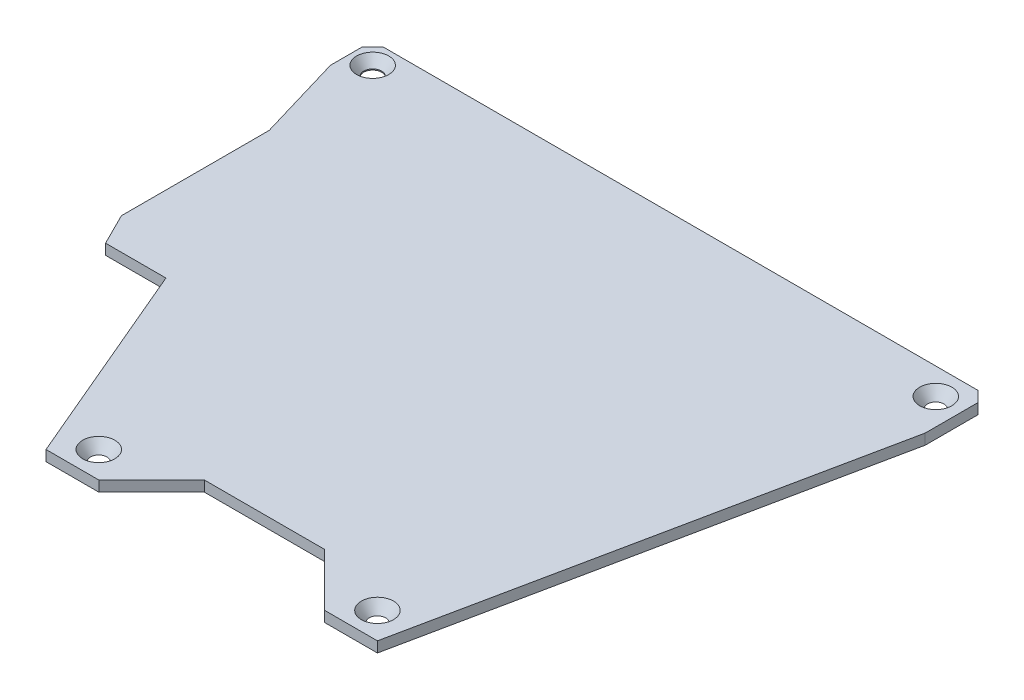
ISO-10303-21;
HEADER;
FILE_DESCRIPTION(('STEP AP214'),'2;1');
FILE_NAME('part.step','',(''),(''),'','','');
FILE_SCHEMA(('AUTOMOTIVE_DESIGN { 1 0 10303 214 1 1 1 1 }'));
ENDSEC;
DATA;
#1=APPLICATION_CONTEXT('core data for automotive mechanical design processes');
#2=APPLICATION_PROTOCOL_DEFINITION('international standard','automotive_design',2000,#1);
#3=PRODUCT_CONTEXT('',#1,'mechanical');
#4=PRODUCT('Part','Part','',(#3));
#5=PRODUCT_RELATED_PRODUCT_CATEGORY('part','',(#4));
#6=PRODUCT_DEFINITION_FORMATION('','',#4);
#7=PRODUCT_DEFINITION_CONTEXT('part definition',#1,'design');
#8=PRODUCT_DEFINITION('design','',#6,#7);
#9=PRODUCT_DEFINITION_SHAPE('','',#8);
#10=(LENGTH_UNIT() NAMED_UNIT(*) SI_UNIT(.MILLI.,.METRE.));
#11=(NAMED_UNIT(*) PLANE_ANGLE_UNIT() SI_UNIT($,.RADIAN.));
#12=(NAMED_UNIT(*) SI_UNIT($,.STERADIAN.) SOLID_ANGLE_UNIT());
#13=UNCERTAINTY_MEASURE_WITH_UNIT(LENGTH_MEASURE(1.E-05),#10,'distance_accuracy_value','');
#14=(GEOMETRIC_REPRESENTATION_CONTEXT(3) GLOBAL_UNCERTAINTY_ASSIGNED_CONTEXT((#13)) GLOBAL_UNIT_ASSIGNED_CONTEXT((#10,
#11,#12)) REPRESENTATION_CONTEXT('',''));
#15=CARTESIAN_POINT('',(0.,0.,0.));
#16=DIRECTION('',(0.,0.,1.));
#17=DIRECTION('',(1.,0.,0.));
#18=AXIS2_PLACEMENT_3D('',#15,#16,#17);
#19=CARTESIAN_POINT('',(-62.5600947046115,254.946051229394,83.7172856261732));
#20=DIRECTION('',(0.,1.,0.));
#21=DIRECTION('',(0.,0.,1.));
#22=AXIS2_PLACEMENT_3D('',#19,#20,#21);
#23=CYLINDRICAL_SURFACE('',#22,1.7);
#24=DIRECTION('',(0.,1.,0.));
#25=VECTOR('',#24,1.);
#26=CARTESIAN_POINT('',(-62.5600947046115,254.946051229395,85.4172856261731));
#27=LINE('',#26,#25);
#28=CARTESIAN_POINT('',(-62.5600947046113,262.946051229395,85.4172856261729));
#29=VERTEX_POINT('',#28);
#30=CARTESIAN_POINT('',(-62.5600947046113,263.146051229395,85.4172856261728));
#31=VERTEX_POINT('',#30);
#32=EDGE_CURVE('E50',#29,#31,#27,.T.);
#33=ORIENTED_EDGE('',*,*,#32,.T.);
#34=CARTESIAN_POINT('',(-62.5600947046113,263.146051229395,83.7172856261729));
#35=DIRECTION('',(0.,1.,0.));
#36=DIRECTION('',(0.,0.,1.));
#37=AXIS2_PLACEMENT_3D('',#34,#35,#36);
#38=CIRCLE('',#37,1.7);
#39=CARTESIAN_POINT('',(-62.5600947046113,263.146051229395,82.0172856261729));
#40=VERTEX_POINT('',#39);
#41=EDGE_CURVE('E57',#31,#40,#38,.T.);
#42=ORIENTED_EDGE('',*,*,#41,.T.);
#43=DIRECTION('',(0.,1.,0.));
#44=VECTOR('',#43,1.);
#45=CARTESIAN_POINT('',(-62.5600947046115,254.946051229394,82.0172856261732));
#46=LINE('',#45,#44);
#47=CARTESIAN_POINT('',(-62.5600947046113,262.946051229395,82.0172856261729));
#48=VERTEX_POINT('',#47);
#49=EDGE_CURVE('E246',#48,#40,#46,.T.);
#50=ORIENTED_EDGE('',*,*,#49,.F.);
#51=CARTESIAN_POINT('',(-62.5600947046113,262.946051229395,83.7172856261729));
#52=DIRECTION('',(0.,1.,0.));
#53=DIRECTION('',(0.,0.,1.));
#54=AXIS2_PLACEMENT_3D('',#51,#52,#53);
#55=CIRCLE('',#54,1.7);
#56=EDGE_CURVE('E334',#29,#48,#55,.T.);
#57=ORIENTED_EDGE('',*,*,#56,.F.);
#58=EDGE_LOOP('',(#33,#42,#50,#57));
#59=FACE_BOUND('',#58,.T.);
#60=ADVANCED_FACE('F40',(#59),#23,.F.);
#61=CARTESIAN_POINT('',(-66.5600947046043,264.946051229394,81.7172856261735));
#62=DIRECTION('',(-0.707106781192606,0.,-0.707106781180489));
#63=DIRECTION('',(-0.707106781180489,0.,0.707106781192606));
#64=AXIS2_PLACEMENT_3D('',#61,#62,#63);
#65=PLANE('',#64);
#66=DIRECTION('',(0.707106781180489,0.,-0.707106781192606));
#67=VECTOR('',#66,1.);
#68=CARTESIAN_POINT('',(-66.5600947046043,264.946051229394,81.7172856261735));
#69=LINE('',#68,#67);
#70=CARTESIAN_POINT('',(-66.5600947046043,264.946051229394,81.7172856261735));
#71=VERTEX_POINT('',#70);
#72=CARTESIAN_POINT('',(-64.5600947046386,264.946051229394,79.7172856261736));
#73=VERTEX_POINT('',#72);
#74=EDGE_CURVE('E211',#71,#73,#69,.T.);
#75=ORIENTED_EDGE('',*,*,#74,.T.);
#76=DIRECTION('',(0.,-1.,0.));
#77=VECTOR('',#76,1.);
#78=CARTESIAN_POINT('',(-64.5600947046386,264.946051229394,79.7172856261736));
#79=LINE('',#78,#77);
#80=CARTESIAN_POINT('',(-64.5600947046386,262.946051229394,79.7172856261736));
#81=VERTEX_POINT('',#80);
#82=EDGE_CURVE('E203',#73,#81,#79,.T.);
#83=ORIENTED_EDGE('',*,*,#82,.T.);
#84=DIRECTION('',(0.707106781180489,0.,-0.707106781192606));
#85=VECTOR('',#84,1.);
#86=CARTESIAN_POINT('',(-66.5600947046043,262.946051229394,81.7172856261736));
#87=LINE('',#86,#85);
#88=CARTESIAN_POINT('',(-66.5600947046043,262.946051229394,81.7172856261736));
#89=VERTEX_POINT('',#88);
#90=EDGE_CURVE('E208',#89,#81,#87,.T.);
#91=ORIENTED_EDGE('',*,*,#90,.F.);
#92=DIRECTION('',(0.,-1.,0.));
#93=VECTOR('',#92,1.);
#94=CARTESIAN_POINT('',(-66.5600947046043,264.946051229394,81.7172856261735));
#95=LINE('',#94,#93);
#96=EDGE_CURVE('E12',#71,#89,#95,.T.);
#97=ORIENTED_EDGE('',*,*,#96,.F.);
#98=EDGE_LOOP('',(#75,#83,#91,#97));
#99=FACE_BOUND('',#98,.T.);
#100=ADVANCED_FACE('F205',(#99),#65,.T.);
#101=CARTESIAN_POINT('',(-66.5600947046217,262.946051229395,85.7172856261758));
#102=DIRECTION('',(-1.,0.,0.));
#103=DIRECTION('',(0.,0.,1.));
#104=AXIS2_PLACEMENT_3D('',#101,#102,#103);
#105=PLANE('',#104);
#106=DIRECTION('',(0.,0.,-1.));
#107=VECTOR('',#106,1.);
#108=CARTESIAN_POINT('',(-66.5600947046216,262.946051229394,85.717285626175));
#109=LINE('',#108,#107);
#110=CARTESIAN_POINT('',(-66.5600947046217,262.946051229395,87.7172856261758));
#111=VERTEX_POINT('',#110);
#112=EDGE_CURVE('E232',#111,#89,#109,.T.);
#113=ORIENTED_EDGE('',*,*,#112,.F.);
#114=DIRECTION('',(0.,1.,0.));
#115=VECTOR('',#114,1.);
#116=CARTESIAN_POINT('',(-66.5600947046217,262.946051229395,87.7172856261758));
#117=LINE('',#116,#115);
#118=CARTESIAN_POINT('',(-66.5600947046217,264.946051229395,87.7172856261757));
#119=VERTEX_POINT('',#118);
#120=EDGE_CURVE('E244',#111,#119,#117,.T.);
#121=ORIENTED_EDGE('',*,*,#120,.T.);
#122=DIRECTION('',(0.,0.,-1.));
#123=VECTOR('',#122,1.);
#124=CARTESIAN_POINT('',(-66.5600947046216,264.946051229394,85.7172856261748));
#125=LINE('',#124,#123);
#126=EDGE_CURVE('E286',#119,#71,#125,.T.);
#127=ORIENTED_EDGE('',*,*,#126,.T.);
#128=ORIENTED_EDGE('',*,*,#96,.T.);
#129=EDGE_LOOP('',(#113,#121,#127,#128));
#130=FACE_BOUND('',#129,.T.);
#131=ADVANCED_FACE('F42',(#130),#105,.T.);
#132=CARTESIAN_POINT('',(-62.5600947046115,254.946051229394,83.7172856261732));
#133=DIRECTION('',(0.,1.,0.));
#134=DIRECTION('',(0.,0.,1.));
#135=AXIS2_PLACEMENT_3D('',#132,#133,#134);
#136=CYLINDRICAL_SURFACE('',#135,1.7);
#137=ORIENTED_EDGE('',*,*,#49,.T.);
#138=CARTESIAN_POINT('',(-62.5600947046113,263.146051229395,83.7172856261729));
#139=DIRECTION('',(0.,1.,0.));
#140=DIRECTION('',(0.,0.,1.));
#141=AXIS2_PLACEMENT_3D('',#138,#139,#140);
#142=CIRCLE('',#141,1.7);
#143=EDGE_CURVE('E374',#40,#31,#142,.T.);
#144=ORIENTED_EDGE('',*,*,#143,.T.);
#145=ORIENTED_EDGE('',*,*,#32,.F.);
#146=CARTESIAN_POINT('',(-62.5600947046113,262.946051229395,83.7172856261729));
#147=DIRECTION('',(0.,1.,0.));
#148=DIRECTION('',(0.,0.,1.));
#149=AXIS2_PLACEMENT_3D('',#146,#147,#148);
#150=CIRCLE('',#149,1.7);
#151=EDGE_CURVE('E216',#48,#29,#150,.T.);
#152=ORIENTED_EDGE('',*,*,#151,.F.);
#153=EDGE_LOOP('',(#137,#144,#145,#152));
#154=FACE_BOUND('',#153,.T.);
#155=ADVANCED_FACE('F373',(#154),#136,.F.);
#156=CARTESIAN_POINT('',(-66.5600947046217,262.946051229395,87.7172856261758));
#157=DIRECTION('',(-0.958873603596452,0.,0.283833423553244));
#158=DIRECTION('',(0.,1.,0.));
#159=AXIS2_PLACEMENT_3D('',#156,#157,#158);
#160=PLANE('',#159);
#161=DIRECTION('',(0.283833423553243,0.,0.958873603596452));
#162=VECTOR('',#161,1.);
#163=CARTESIAN_POINT('',(-66.5600947046217,264.946051229395,87.7172856261757));
#164=LINE('',#163,#162);
#165=CARTESIAN_POINT('',(-61.6759770575587,264.946051229394,104.217285626175));
#166=VERTEX_POINT('',#165);
#167=EDGE_CURVE('E281',#119,#166,#164,.T.);
#168=ORIENTED_EDGE('',*,*,#167,.F.);
#169=ORIENTED_EDGE('',*,*,#120,.F.);
#170=DIRECTION('',(0.283833423553243,0.,0.958873603596452));
#171=VECTOR('',#170,1.);
#172=CARTESIAN_POINT('',(-66.5600947046217,262.946051229395,87.7172856261758));
#173=LINE('',#172,#171);
#174=CARTESIAN_POINT('',(-61.6759770575587,262.946051229395,104.217285626175));
#175=VERTEX_POINT('',#174);
#176=EDGE_CURVE('E352',#111,#175,#173,.T.);
#177=ORIENTED_EDGE('',*,*,#176,.T.);
#178=DIRECTION('',(0.,1.,0.));
#179=VECTOR('',#178,1.);
#180=CARTESIAN_POINT('',(-61.6759770575587,263.946051229395,104.217285626176));
#181=LINE('',#180,#179);
#182=EDGE_CURVE('E44',#175,#166,#181,.T.);
#183=ORIENTED_EDGE('',*,*,#182,.T.);
#184=EDGE_LOOP('',(#168,#169,#177,#183));
#185=FACE_BOUND('',#184,.T.);
#186=ADVANCED_FACE('F406',(#185),#160,.T.);
#187=CARTESIAN_POINT('',(-61.6759770575587,264.946051229396,138.217285626175));
#188=DIRECTION('',(-1.,0.,0.));
#189=DIRECTION('',(0.,0.,1.));
#190=AXIS2_PLACEMENT_3D('',#187,#188,#189);
#191=PLANE('',#190);
#192=DIRECTION('',(0.,-1.,0.));
#193=VECTOR('',#192,1.);
#194=CARTESIAN_POINT('',(-61.6759770575587,264.946051229395,132.217285626175));
#195=LINE('',#194,#193);
#196=CARTESIAN_POINT('',(-61.6759770575587,264.946051229395,132.217285626175));
#197=VERTEX_POINT('',#196);
#198=CARTESIAN_POINT('',(-61.6759770575588,262.946051229395,132.217285626175));
#199=VERTEX_POINT('',#198);
#200=EDGE_CURVE('E70',#197,#199,#195,.T.);
#201=ORIENTED_EDGE('',*,*,#200,.F.);
#202=DIRECTION('',(0.,0.,1.));
#203=VECTOR('',#202,1.);
#204=CARTESIAN_POINT('',(-61.6759770575587,264.946051229394,104.217285626175));
#205=LINE('',#204,#203);
#206=EDGE_CURVE('E285',#166,#197,#205,.T.);
#207=ORIENTED_EDGE('',*,*,#206,.F.);
#208=ORIENTED_EDGE('',*,*,#182,.F.);
#209=DIRECTION('',(0.,0.,-1.));
#210=VECTOR('',#209,1.);
#211=CARTESIAN_POINT('',(-61.6759770575588,262.946051229394,104.217285626175));
#212=LINE('',#211,#210);
#213=EDGE_CURVE('E348',#199,#175,#212,.T.);
#214=ORIENTED_EDGE('',*,*,#213,.F.);
#215=EDGE_LOOP('',(#201,#207,#208,#214));
#216=FACE_BOUND('',#215,.T.);
#217=ADVANCED_FACE('F411',(#216),#191,.T.);
#218=CARTESIAN_POINT('',(-60.1759770575587,264.946051229395,135.217285626175));
#219=DIRECTION('',(-0.894427190999917,0.,0.447213595499956));
#220=DIRECTION('',(0.,1.,0.));
#221=AXIS2_PLACEMENT_3D('',#218,#219,#220);
#222=PLANE('',#221);
#223=DIRECTION('',(0.447213595499956,0.,0.894427190999917));
#224=VECTOR('',#223,1.);
#225=CARTESIAN_POINT('',(-56.2793888222658,262.946051229397,143.010462096761));
#226=LINE('',#225,#224);
#227=CARTESIAN_POINT('',(-58.6759770575588,262.946051229396,138.217285626175));
#228=VERTEX_POINT('',#227);
#229=EDGE_CURVE('E226',#199,#228,#226,.T.);
#230=ORIENTED_EDGE('',*,*,#229,.T.);
#231=DIRECTION('',(0.,1.,0.));
#232=VECTOR('',#231,1.);
#233=CARTESIAN_POINT('',(-58.6759770575587,264.946051229396,138.217285626175));
#234=LINE('',#233,#232);
#235=CARTESIAN_POINT('',(-58.6759770575587,264.946051229396,138.217285626175));
#236=VERTEX_POINT('',#235);
#237=EDGE_CURVE('E264',#228,#236,#234,.T.);
#238=ORIENTED_EDGE('',*,*,#237,.T.);
#239=DIRECTION('',(-0.447213595499956,0.,-0.894427190999917));
#240=VECTOR('',#239,1.);
#241=CARTESIAN_POINT('',(-56.2793888222657,264.946051229396,143.010462096761));
#242=LINE('',#241,#240);
#243=EDGE_CURVE('E338',#236,#197,#242,.T.);
#244=ORIENTED_EDGE('',*,*,#243,.T.);
#245=ORIENTED_EDGE('',*,*,#200,.T.);
#246=EDGE_LOOP('',(#230,#238,#244,#245));
#247=FACE_BOUND('',#246,.T.);
#248=ADVANCED_FACE('F455',(#247),#222,.T.);
#249=CARTESIAN_POINT('',(-8.21009470462757,264.946051229395,128.717285626174));
#250=DIRECTION('',(0.,1.,0.));
#251=DIRECTION('',(0.,0.,-1.));
#252=AXIS2_PLACEMENT_3D('',#249,#250,#251);
#253=PLANE('',#252);
#254=CARTESIAN_POINT('',(-62.5600947046113,264.946051229395,83.7172856261728));
#255=DIRECTION('',(0.,-1.,0.));
#256=DIRECTION('',(0.,0.,-1.));
#257=AXIS2_PLACEMENT_3D('',#254,#255,#256);
#258=CIRCLE('',#257,3.04999999999761);
#259=CARTESIAN_POINT('',(-62.5600947046113,264.946051229395,80.6672856261752));
#260=VERTEX_POINT('',#259);
#261=EDGE_CURVE('E630',#260,#260,#258,.T.);
#262=ORIENTED_EDGE('',*,*,#261,.T.);
#263=EDGE_LOOP('',(#262));
#264=FACE_BOUND('',#263,.T.);
#265=CARTESIAN_POINT('',(45.1399052953661,264.946051229393,84.7172856261732));
#266=DIRECTION('',(0.,-1.,0.));
#267=DIRECTION('',(0.,0.,-1.));
#268=AXIS2_PLACEMENT_3D('',#265,#266,#267);
#269=CIRCLE('',#268,3.0499999999976);
#270=CARTESIAN_POINT('',(45.1399052953661,264.946051229393,81.6672856261756));
#271=VERTEX_POINT('',#270);
#272=EDGE_CURVE('E634',#271,#271,#269,.T.);
#273=ORIENTED_EDGE('',*,*,#272,.T.);
#274=EDGE_LOOP('',(#273));
#275=FACE_BOUND('',#274,.T.);
#276=CARTESIAN_POINT('',(27.3399052954042,264.946051229395,172.717285626173));
#277=DIRECTION('',(0.,-1.,0.));
#278=DIRECTION('',(0.,0.,-1.));
#279=AXIS2_PLACEMENT_3D('',#276,#277,#278);
#280=CIRCLE('',#279,3.0499999999976);
#281=CARTESIAN_POINT('',(27.3399052954042,264.946051229395,169.667285626175));
#282=VERTEX_POINT('',#281);
#283=EDGE_CURVE('E629',#282,#282,#280,.T.);
#284=ORIENTED_EDGE('',*,*,#283,.T.);
#285=EDGE_LOOP('',(#284));
#286=FACE_BOUND('',#285,.T.);
#287=CARTESIAN_POINT('',(-25.460094704595,264.946051229397,172.717285626173));
#288=DIRECTION('',(0.,-1.,0.));
#289=DIRECTION('',(0.,0.,-1.));
#290=AXIS2_PLACEMENT_3D('',#287,#288,#289);
#291=CIRCLE('',#290,3.0499999999976);
#292=CARTESIAN_POINT('',(-25.460094704595,264.946051229397,169.667285626175));
#293=VERTEX_POINT('',#292);
#294=EDGE_CURVE('E594',#293,#293,#291,.T.);
#295=ORIENTED_EDGE('',*,*,#294,.T.);
#296=EDGE_LOOP('',(#295));
#297=FACE_BOUND('',#296,.T.);
#298=DIRECTION('',(-1.,0.,0.));
#299=VECTOR('',#298,1.);
#300=CARTESIAN_POINT('',(-55.5600947045993,264.946051229395,79.7172856261739));
#301=LINE('',#300,#299);
#302=CARTESIAN_POINT('',(48.1399052953661,264.946051229393,79.7172856261739));
#303=VERTEX_POINT('',#302);
#304=EDGE_CURVE('E215',#303,#73,#301,.T.);
#305=ORIENTED_EDGE('',*,*,#304,.T.);
#306=ORIENTED_EDGE('',*,*,#74,.F.);
#307=ORIENTED_EDGE('',*,*,#126,.F.);
#308=ORIENTED_EDGE('',*,*,#167,.T.);
#309=ORIENTED_EDGE('',*,*,#206,.T.);
#310=ORIENTED_EDGE('',*,*,#243,.F.);
#311=DIRECTION('',(1.,0.,0.));
#312=VECTOR('',#311,1.);
#313=CARTESIAN_POINT('',(-61.6759770575587,264.946051229396,138.217285626175));
#314=LINE('',#313,#312);
#315=CARTESIAN_POINT('',(-47.2359770575479,264.946051229395,138.217285626175));
#316=VERTEX_POINT('',#315);
#317=EDGE_CURVE('E295',#236,#316,#314,.T.);
#318=ORIENTED_EDGE('',*,*,#317,.T.);
#319=DIRECTION('',(0.390911330826302,0.,0.920428341280086));
#320=VECTOR('',#319,1.);
#321=CARTESIAN_POINT('',(-30.4600947045951,264.946051229397,177.717285626175));
#322=LINE('',#321,#320);
#323=CARTESIAN_POINT('',(-30.4600947045951,264.946051229397,177.717285626175));
#324=VERTEX_POINT('',#323);
#325=EDGE_CURVE('E182',#316,#324,#322,.T.);
#326=ORIENTED_EDGE('',*,*,#325,.T.);
#327=DIRECTION('',(1.,0.,0.));
#328=VECTOR('',#327,1.);
#329=CARTESIAN_POINT('',(-30.4600947045951,264.946051229397,177.717285626175));
#330=LINE('',#329,#328);
#331=CARTESIAN_POINT('',(-20.4600947045951,264.946051229396,177.717285626173));
#332=VERTEX_POINT('',#331);
#333=EDGE_CURVE('E333',#324,#332,#330,.T.);
#334=ORIENTED_EDGE('',*,*,#333,.T.);
#335=DIRECTION('',(0.707106781186548,0.,-0.707106781186547));
#336=VECTOR('',#335,1.);
#337=CARTESIAN_POINT('',(-5.1475947046036,264.946051229396,162.404785626181));
#338=LINE('',#337,#336);
#339=CARTESIAN_POINT('',(-10.4600947045951,264.946051229396,167.717285626173));
#340=VERTEX_POINT('',#339);
#341=EDGE_CURVE('E273',#332,#340,#338,.T.);
#342=ORIENTED_EDGE('',*,*,#341,.T.);
#343=DIRECTION('',(1.,0.,0.));
#344=VECTOR('',#343,1.);
#345=CARTESIAN_POINT('',(-9.33509470461128,264.946051229396,167.717285626173));
#346=LINE('',#345,#344);
#347=CARTESIAN_POINT('',(12.3399052954042,264.946051229395,167.717285626173));
#348=VERTEX_POINT('',#347);
#349=EDGE_CURVE('E304',#340,#348,#346,.T.);
#350=ORIENTED_EDGE('',*,*,#349,.T.);
#351=DIRECTION('',(0.707106781186547,0.,0.707106781186548));
#352=VECTOR('',#351,1.);
#353=CARTESIAN_POINT('',(-2.54759470460338,264.946051229396,152.829785626165));
#354=LINE('',#353,#352);
#355=CARTESIAN_POINT('',(22.3399052954041,264.946051229395,177.717285626173));
#356=VERTEX_POINT('',#355);
#357=EDGE_CURVE('E257',#348,#356,#354,.T.);
#358=ORIENTED_EDGE('',*,*,#357,.T.);
#359=DIRECTION('',(1.,0.,0.));
#360=VECTOR('',#359,1.);
#361=CARTESIAN_POINT('',(-30.4600947045951,264.946051229397,177.717285626175));
#362=LINE('',#361,#360);
#363=CARTESIAN_POINT('',(32.3399052954042,264.946051229396,177.717285626174));
#364=VERTEX_POINT('',#363);
#365=EDGE_CURVE('E324',#356,#364,#362,.T.);
#366=ORIENTED_EDGE('',*,*,#365,.T.);
#367=DIRECTION('',(0.2026809079902,0.,-0.979244836359257));
#368=VECTOR('',#367,1.);
#369=CARTESIAN_POINT('',(50.139905295366,264.946051229393,91.7172856261734));
#370=LINE('',#369,#368);
#371=CARTESIAN_POINT('',(50.139905295366,264.946051229393,91.7172856261734));
#372=VERTEX_POINT('',#371);
#373=EDGE_CURVE('E280',#364,#372,#370,.T.);
#374=ORIENTED_EDGE('',*,*,#373,.T.);
#375=DIRECTION('',(0.,0.,-1.));
#376=VECTOR('',#375,1.);
#377=CARTESIAN_POINT('',(50.1399052953661,264.946051229393,79.717285626174));
#378=LINE('',#377,#376);
#379=CARTESIAN_POINT('',(50.1399052953661,264.946051229393,81.717285626174));
#380=VERTEX_POINT('',#379);
#381=EDGE_CURVE('E247',#372,#380,#378,.T.);
#382=ORIENTED_EDGE('',*,*,#381,.T.);
#383=DIRECTION('',(0.707106781186529,0.,0.707106781186566));
#384=VECTOR('',#383,1.);
#385=CARTESIAN_POINT('',(46.8024052953685,264.946051229392,78.3797856261762));
#386=LINE('',#385,#384);
#387=EDGE_CURVE('E276',#303,#380,#386,.T.);
#388=ORIENTED_EDGE('',*,*,#387,.F.);
#389=EDGE_LOOP('',(#305,#306,#307,#308,#309,#310,#318,#326,#334,#342,#350,#358,#366,#374,#382,#388));
#390=FACE_BOUND('',#389,.T.);
#391=ADVANCED_FACE('F459',(#264,#275,#286,#297,#390),#253,.T.);
#392=CARTESIAN_POINT('',(50.1399052953661,262.946051229393,79.717285626174));
#393=DIRECTION('',(0.,0.,-1.));
#394=DIRECTION('',(0.,-1.,0.));
#395=AXIS2_PLACEMENT_3D('',#392,#393,#394);
#396=PLANE('',#395);
#397=DIRECTION('',(0.,1.,0.));
#398=VECTOR('',#397,1.);
#399=CARTESIAN_POINT('',(48.1399052953661,262.946051229393,79.717285626174));
#400=LINE('',#399,#398);
#401=CARTESIAN_POINT('',(48.1399052953661,262.946051229393,79.717285626174));
#402=VERTEX_POINT('',#401);
#403=EDGE_CURVE('E223',#402,#303,#400,.T.);
#404=ORIENTED_EDGE('',*,*,#403,.F.);
#405=DIRECTION('',(1.,0.,0.));
#406=VECTOR('',#405,1.);
#407=CARTESIAN_POINT('',(-55.5600947045994,262.946051229395,79.717285626174));
#408=LINE('',#407,#406);
#409=EDGE_CURVE('E220',#81,#402,#408,.T.);
#410=ORIENTED_EDGE('',*,*,#409,.F.);
#411=ORIENTED_EDGE('',*,*,#82,.F.);
#412=ORIENTED_EDGE('',*,*,#304,.F.);
#413=EDGE_LOOP('',(#404,#410,#411,#412));
#414=FACE_BOUND('',#413,.T.);
#415=ADVANCED_FACE('F221',(#414),#396,.T.);
#416=CARTESIAN_POINT('',(-8.21009470462761,262.946051229395,128.717285626174));
#417=DIRECTION('',(0.,1.,0.));
#418=DIRECTION('',(0.,0.,-1.));
#419=AXIS2_PLACEMENT_3D('',#416,#417,#418);
#420=PLANE('',#419);
#421=CARTESIAN_POINT('',(45.1399052953661,262.946051229393,84.7172856261733));
#422=DIRECTION('',(0.,-1.,0.));
#423=DIRECTION('',(0.,0.,-1.));
#424=AXIS2_PLACEMENT_3D('',#421,#422,#423);
#425=CIRCLE('',#424,1.55);
#426=CARTESIAN_POINT('',(45.1399052953661,262.946051229393,83.1672856261733));
#427=VERTEX_POINT('',#426);
#428=EDGE_CURVE('E633',#427,#427,#425,.T.);
#429=ORIENTED_EDGE('',*,*,#428,.F.);
#430=EDGE_LOOP('',(#429));
#431=FACE_BOUND('',#430,.T.);
#432=CARTESIAN_POINT('',(27.3399052954042,262.946051229395,172.717285626173));
#433=DIRECTION('',(0.,-1.,0.));
#434=DIRECTION('',(0.,0.,-1.));
#435=AXIS2_PLACEMENT_3D('',#432,#433,#434);
#436=CIRCLE('',#435,1.55);
#437=CARTESIAN_POINT('',(27.3399052954042,262.946051229395,171.167285626173));
#438=VERTEX_POINT('',#437);
#439=EDGE_CURVE('E637',#438,#438,#436,.T.);
#440=ORIENTED_EDGE('',*,*,#439,.F.);
#441=EDGE_LOOP('',(#440));
#442=FACE_BOUND('',#441,.T.);
#443=CARTESIAN_POINT('',(-25.460094704595,262.946051229397,172.717285626173));
#444=DIRECTION('',(0.,-1.,0.));
#445=DIRECTION('',(0.,0.,-1.));
#446=AXIS2_PLACEMENT_3D('',#443,#444,#445);
#447=CIRCLE('',#446,1.55);
#448=CARTESIAN_POINT('',(-25.460094704595,262.946051229397,171.167285626173));
#449=VERTEX_POINT('',#448);
#450=EDGE_CURVE('E598',#449,#449,#447,.T.);
#451=ORIENTED_EDGE('',*,*,#450,.F.);
#452=EDGE_LOOP('',(#451));
#453=FACE_BOUND('',#452,.T.);
#454=ORIENTED_EDGE('',*,*,#56,.T.);
#455=ORIENTED_EDGE('',*,*,#151,.T.);
#456=EDGE_LOOP('',(#454,#455));
#457=FACE_BOUND('',#456,.T.);
#458=ORIENTED_EDGE('',*,*,#90,.T.);
#459=ORIENTED_EDGE('',*,*,#409,.T.);
#460=DIRECTION('',(-0.707106781186529,0.,-0.707106781186566));
#461=VECTOR('',#460,1.);
#462=CARTESIAN_POINT('',(46.8024052953685,262.946051229393,78.3797856261763));
#463=LINE('',#462,#461);
#464=CARTESIAN_POINT('',(50.1399052953661,262.946051229393,81.7172856261741));
#465=VERTEX_POINT('',#464);
#466=EDGE_CURVE('E239',#465,#402,#463,.T.);
#467=ORIENTED_EDGE('',*,*,#466,.F.);
#468=DIRECTION('',(0.,0.,1.));
#469=VECTOR('',#468,1.);
#470=CARTESIAN_POINT('',(50.1399052953661,262.946051229393,79.7172856261741));
#471=LINE('',#470,#469);
#472=CARTESIAN_POINT('',(50.139905295366,262.946051229393,91.7172856261734));
#473=VERTEX_POINT('',#472);
#474=EDGE_CURVE('E251',#465,#473,#471,.T.);
#475=ORIENTED_EDGE('',*,*,#474,.T.);
#476=DIRECTION('',(-0.2026809079902,0.,0.979244836359257));
#477=VECTOR('',#476,1.);
#478=CARTESIAN_POINT('',(50.139905295366,262.946051229393,91.7172856261734));
#479=LINE('',#478,#477);
#480=CARTESIAN_POINT('',(32.3399052954042,262.946051229396,177.717285626174));
#481=VERTEX_POINT('',#480);
#482=EDGE_CURVE('E327',#473,#481,#479,.T.);
#483=ORIENTED_EDGE('',*,*,#482,.T.);
#484=DIRECTION('',(1.,0.,0.));
#485=VECTOR('',#484,1.);
#486=CARTESIAN_POINT('',(-30.4600947045951,262.946051229397,177.717285626175));
#487=LINE('',#486,#485);
#488=CARTESIAN_POINT('',(22.3399052954041,262.946051229396,177.717285626173));
#489=VERTEX_POINT('',#488);
#490=EDGE_CURVE('E382',#489,#481,#487,.T.);
#491=ORIENTED_EDGE('',*,*,#490,.F.);
#492=DIRECTION('',(-0.707106781186547,0.,-0.707106781186548));
#493=VECTOR('',#492,1.);
#494=CARTESIAN_POINT('',(-2.54759470460343,262.946051229396,152.829785626165));
#495=LINE('',#494,#493);
#496=CARTESIAN_POINT('',(12.3399052954041,262.946051229396,167.717285626173));
#497=VERTEX_POINT('',#496);
#498=EDGE_CURVE('E258',#489,#497,#495,.T.);
#499=ORIENTED_EDGE('',*,*,#498,.T.);
#500=DIRECTION('',(-1.,0.,0.));
#501=VECTOR('',#500,1.);
#502=CARTESIAN_POINT('',(-9.33509470461132,262.946051229396,167.717285626173));
#503=LINE('',#502,#501);
#504=CARTESIAN_POINT('',(-10.4600947045951,262.946051229396,167.717285626173));
#505=VERTEX_POINT('',#504);
#506=EDGE_CURVE('E269',#497,#505,#503,.T.);
#507=ORIENTED_EDGE('',*,*,#506,.T.);
#508=DIRECTION('',(-0.707106781186548,0.,0.707106781186547));
#509=VECTOR('',#508,1.);
#510=CARTESIAN_POINT('',(-5.14759470460364,262.946051229396,162.404785626181));
#511=LINE('',#510,#509);
#512=CARTESIAN_POINT('',(-20.4600947045952,262.946051229397,177.717285626173));
#513=VERTEX_POINT('',#512);
#514=EDGE_CURVE('E298',#505,#513,#511,.T.);
#515=ORIENTED_EDGE('',*,*,#514,.T.);
#516=DIRECTION('',(1.,0.,0.));
#517=VECTOR('',#516,1.);
#518=CARTESIAN_POINT('',(-30.4600947045951,262.946051229397,177.717285626175));
#519=LINE('',#518,#517);
#520=CARTESIAN_POINT('',(-30.4600947045951,262.946051229397,177.717285626175));
#521=VERTEX_POINT('',#520);
#522=EDGE_CURVE('E193',#521,#513,#519,.T.);
#523=ORIENTED_EDGE('',*,*,#522,.F.);
#524=DIRECTION('',(-0.390911330826302,0.,-0.920428341280086));
#525=VECTOR('',#524,1.);
#526=CARTESIAN_POINT('',(-30.4600947045951,262.946051229397,177.717285626175));
#527=LINE('',#526,#525);
#528=CARTESIAN_POINT('',(-47.235977057548,262.946051229395,138.217285626175));
#529=VERTEX_POINT('',#528);
#530=EDGE_CURVE('E268',#521,#529,#527,.T.);
#531=ORIENTED_EDGE('',*,*,#530,.T.);
#532=DIRECTION('',(-1.,0.,0.));
#533=VECTOR('',#532,1.);
#534=CARTESIAN_POINT('',(-61.6759770575588,262.946051229396,138.217285626175));
#535=LINE('',#534,#533);
#536=EDGE_CURVE('E259',#529,#228,#535,.T.);
#537=ORIENTED_EDGE('',*,*,#536,.T.);
#538=ORIENTED_EDGE('',*,*,#229,.F.);
#539=ORIENTED_EDGE('',*,*,#213,.T.);
#540=ORIENTED_EDGE('',*,*,#176,.F.);
#541=ORIENTED_EDGE('',*,*,#112,.T.);
#542=EDGE_LOOP('',(#458,#459,#467,#475,#483,#491,#499,#507,#515,#523,#531,#537,#538,#539,#540,#541));
#543=FACE_BOUND('',#542,.T.);
#544=ADVANCED_FACE('F229',(#431,#442,#453,#457,#543),#420,.F.);
#545=CARTESIAN_POINT('',(49.1399052953661,262.946051229393,80.717285626174));
#546=DIRECTION('',(0.707106781186566,0.,-0.707106781186529));
#547=DIRECTION('',(0.,-1.,0.));
#548=AXIS2_PLACEMENT_3D('',#545,#546,#547);
#549=PLANE('',#548);
#550=ORIENTED_EDGE('',*,*,#387,.T.);
#551=DIRECTION('',(0.,-1.,0.));
#552=VECTOR('',#551,1.);
#553=CARTESIAN_POINT('',(50.1399052953661,262.946051229393,81.7172856261741));
#554=LINE('',#553,#552);
#555=EDGE_CURVE('E252',#380,#465,#554,.T.);
#556=ORIENTED_EDGE('',*,*,#555,.T.);
#557=ORIENTED_EDGE('',*,*,#466,.T.);
#558=ORIENTED_EDGE('',*,*,#403,.T.);
#559=EDGE_LOOP('',(#550,#556,#557,#558));
#560=FACE_BOUND('',#559,.T.);
#561=ADVANCED_FACE('F449',(#560),#549,.T.);
#562=CARTESIAN_POINT('',(50.139905295366,262.946051229393,91.7172856261734));
#563=DIRECTION('',(1.,0.,0.));
#564=DIRECTION('',(0.,-1.,0.));
#565=AXIS2_PLACEMENT_3D('',#562,#563,#564);
#566=PLANE('',#565);
#567=ORIENTED_EDGE('',*,*,#555,.F.);
#568=ORIENTED_EDGE('',*,*,#381,.F.);
#569=DIRECTION('',(0.,1.,0.));
#570=VECTOR('',#569,1.);
#571=CARTESIAN_POINT('',(50.139905295366,262.946051229393,91.7172856261734));
#572=LINE('',#571,#570);
#573=EDGE_CURVE('E292',#473,#372,#572,.T.);
#574=ORIENTED_EDGE('',*,*,#573,.F.);
#575=ORIENTED_EDGE('',*,*,#474,.F.);
#576=EDGE_LOOP('',(#567,#568,#574,#575));
#577=FACE_BOUND('',#576,.T.);
#578=ADVANCED_FACE('F420',(#577),#566,.T.);
#579=CARTESIAN_POINT('',(32.3399052954042,262.946051229396,177.717285626174));
#580=DIRECTION('',(0.979244836359257,0.,0.2026809079902));
#581=DIRECTION('',(0.,-1.,0.));
#582=AXIS2_PLACEMENT_3D('',#579,#580,#581);
#583=PLANE('',#582);
#584=ORIENTED_EDGE('',*,*,#482,.F.);
#585=ORIENTED_EDGE('',*,*,#573,.T.);
#586=ORIENTED_EDGE('',*,*,#373,.F.);
#587=DIRECTION('',(0.,1.,0.));
#588=VECTOR('',#587,1.);
#589=CARTESIAN_POINT('',(32.3399052954042,262.946051229396,177.717285626174));
#590=LINE('',#589,#588);
#591=EDGE_CURVE('E328',#481,#364,#590,.T.);
#592=ORIENTED_EDGE('',*,*,#591,.F.);
#593=EDGE_LOOP('',(#584,#585,#586,#592));
#594=FACE_BOUND('',#593,.T.);
#595=ADVANCED_FACE('F414',(#594),#583,.T.);
#596=CARTESIAN_POINT('',(-30.4600947045951,262.946051229397,177.717285626175));
#597=DIRECTION('',(0.,0.,1.));
#598=DIRECTION('',(0.,-1.,0.));
#599=AXIS2_PLACEMENT_3D('',#596,#597,#598);
#600=PLANE('',#599);
#601=DIRECTION('',(0.,-1.,0.));
#602=VECTOR('',#601,1.);
#603=CARTESIAN_POINT('',(22.3399052954058,263.946051229396,177.717285626174));
#604=LINE('',#603,#602);
#605=EDGE_CURVE('E253',#356,#489,#604,.T.);
#606=ORIENTED_EDGE('',*,*,#605,.T.);
#607=ORIENTED_EDGE('',*,*,#490,.T.);
#608=ORIENTED_EDGE('',*,*,#591,.T.);
#609=ORIENTED_EDGE('',*,*,#365,.F.);
#610=EDGE_LOOP('',(#606,#607,#608,#609));
#611=FACE_BOUND('',#610,.T.);
#612=ADVANCED_FACE('F419',(#611),#600,.T.);
#613=CARTESIAN_POINT('',(12.3399052954042,264.946051229395,167.717285626173));
#614=DIRECTION('',(0.707106781186548,0.,-0.707106781186547));
#615=DIRECTION('',(0.,-1.,0.));
#616=AXIS2_PLACEMENT_3D('',#613,#614,#615);
#617=PLANE('',#616);
#618=ORIENTED_EDGE('',*,*,#498,.F.);
#619=ORIENTED_EDGE('',*,*,#605,.F.);
#620=ORIENTED_EDGE('',*,*,#357,.F.);
#621=DIRECTION('',(0.,-1.,0.));
#622=VECTOR('',#621,1.);
#623=CARTESIAN_POINT('',(12.3399052954042,264.946051229395,167.717285626173));
#624=LINE('',#623,#622);
#625=EDGE_CURVE('E272',#348,#497,#624,.T.);
#626=ORIENTED_EDGE('',*,*,#625,.T.);
#627=EDGE_LOOP('',(#618,#619,#620,#626));
#628=FACE_BOUND('',#627,.T.);
#629=ADVANCED_FACE('F431',(#628),#617,.F.);
#630=CARTESIAN_POINT('',(-10.4600947045951,264.946051229396,167.717285626173));
#631=DIRECTION('',(0.,0.,-1.));
#632=DIRECTION('',(0.,-1.,0.));
#633=AXIS2_PLACEMENT_3D('',#630,#631,#632);
#634=PLANE('',#633);
#635=ORIENTED_EDGE('',*,*,#506,.F.);
#636=ORIENTED_EDGE('',*,*,#625,.F.);
#637=ORIENTED_EDGE('',*,*,#349,.F.);
#638=DIRECTION('',(0.,-1.,0.));
#639=VECTOR('',#638,1.);
#640=CARTESIAN_POINT('',(-10.4600947045951,264.946051229396,167.717285626173));
#641=LINE('',#640,#639);
#642=EDGE_CURVE('E301',#340,#505,#641,.T.);
#643=ORIENTED_EDGE('',*,*,#642,.T.);
#644=EDGE_LOOP('',(#635,#636,#637,#643));
#645=FACE_BOUND('',#644,.T.);
#646=ADVANCED_FACE('F426',(#645),#634,.F.);
#647=CARTESIAN_POINT('',(-20.4600947045951,264.946051229396,177.717285626173));
#648=DIRECTION('',(-0.707106781186547,0.,-0.707106781186548));
#649=DIRECTION('',(-0.707106781186548,0.,0.707106781186547));
#650=AXIS2_PLACEMENT_3D('',#647,#648,#649);
#651=PLANE('',#650);
#652=ORIENTED_EDGE('',*,*,#514,.F.);
#653=ORIENTED_EDGE('',*,*,#642,.F.);
#654=ORIENTED_EDGE('',*,*,#341,.F.);
#655=DIRECTION('',(0.,1.,0.));
#656=VECTOR('',#655,1.);
#657=CARTESIAN_POINT('',(-20.4600947045969,263.946051229397,177.717285626175));
#658=LINE('',#657,#656);
#659=EDGE_CURVE('E329',#513,#332,#658,.T.);
#660=ORIENTED_EDGE('',*,*,#659,.F.);
#661=EDGE_LOOP('',(#652,#653,#654,#660));
#662=FACE_BOUND('',#661,.T.);
#663=ADVANCED_FACE('F430',(#662),#651,.F.);
#664=CARTESIAN_POINT('',(-30.4600947045951,262.946051229397,177.717285626175));
#665=DIRECTION('',(0.,0.,1.));
#666=DIRECTION('',(0.,-1.,0.));
#667=AXIS2_PLACEMENT_3D('',#664,#665,#666);
#668=PLANE('',#667);
#669=ORIENTED_EDGE('',*,*,#659,.T.);
#670=ORIENTED_EDGE('',*,*,#333,.F.);
#671=DIRECTION('',(0.,1.,0.));
#672=VECTOR('',#671,1.);
#673=CARTESIAN_POINT('',(-30.4600947045951,262.946051229397,177.717285626175));
#674=LINE('',#673,#672);
#675=EDGE_CURVE('E265',#521,#324,#674,.T.);
#676=ORIENTED_EDGE('',*,*,#675,.F.);
#677=ORIENTED_EDGE('',*,*,#522,.T.);
#678=EDGE_LOOP('',(#669,#670,#676,#677));
#679=FACE_BOUND('',#678,.T.);
#680=ADVANCED_FACE('F440',(#679),#668,.T.);
#681=CARTESIAN_POINT('',(-66.5600947046213,262.946051229395,92.7172856261757));
#682=DIRECTION('',(-0.920428341280086,0.,0.390911330826302));
#683=DIRECTION('',(0.,1.,0.));
#684=AXIS2_PLACEMENT_3D('',#681,#682,#683);
#685=PLANE('',#684);
#686=DIRECTION('',(0.,-1.,0.));
#687=VECTOR('',#686,1.);
#688=CARTESIAN_POINT('',(-47.2359770575486,263.946051229396,138.217285626175));
#689=LINE('',#688,#687);
#690=EDGE_CURVE('E263',#316,#529,#689,.T.);
#691=ORIENTED_EDGE('',*,*,#690,.T.);
#692=ORIENTED_EDGE('',*,*,#530,.F.);
#693=ORIENTED_EDGE('',*,*,#675,.T.);
#694=ORIENTED_EDGE('',*,*,#325,.F.);
#695=EDGE_LOOP('',(#691,#692,#693,#694));
#696=FACE_BOUND('',#695,.T.);
#697=ADVANCED_FACE('F483',(#696),#685,.T.);
#698=CARTESIAN_POINT('',(-47.2359770575479,264.946051229395,138.217285626175));
#699=DIRECTION('',(0.,0.,1.));
#700=DIRECTION('',(0.,-1.,0.));
#701=AXIS2_PLACEMENT_3D('',#698,#699,#700);
#702=PLANE('',#701);
#703=ORIENTED_EDGE('',*,*,#237,.F.);
#704=ORIENTED_EDGE('',*,*,#536,.F.);
#705=ORIENTED_EDGE('',*,*,#690,.F.);
#706=ORIENTED_EDGE('',*,*,#317,.F.);
#707=EDGE_LOOP('',(#703,#704,#705,#706));
#708=FACE_BOUND('',#707,.T.);
#709=ADVANCED_FACE('F487',(#708),#702,.T.);
#710=CARTESIAN_POINT('',(-25.460094704595,262.946051229397,172.717285626173));
#711=DIRECTION('',(0.,1.,0.));
#712=DIRECTION('',(0.,0.,-1.));
#713=AXIS2_PLACEMENT_3D('',#710,#711,#712);
#714=CONICAL_SURFACE('',#713,1.55,0.643501108792518);
#715=ORIENTED_EDGE('',*,*,#294,.F.);
#716=EDGE_LOOP('',(#715));
#717=FACE_BOUND('',#716,.T.);
#718=ORIENTED_EDGE('',*,*,#450,.T.);
#719=EDGE_LOOP('',(#718));
#720=FACE_BOUND('',#719,.T.);
#721=ADVANCED_FACE('F539',(#717,#720),#714,.F.);
#722=CARTESIAN_POINT('',(27.3399052954042,262.946051229395,172.717285626173));
#723=DIRECTION('',(0.,1.,0.));
#724=DIRECTION('',(0.,0.,-1.));
#725=AXIS2_PLACEMENT_3D('',#722,#723,#724);
#726=CONICAL_SURFACE('',#725,1.55,0.643501108792518);
#727=ORIENTED_EDGE('',*,*,#283,.F.);
#728=EDGE_LOOP('',(#727));
#729=FACE_BOUND('',#728,.T.);
#730=ORIENTED_EDGE('',*,*,#439,.T.);
#731=EDGE_LOOP('',(#730));
#732=FACE_BOUND('',#731,.T.);
#733=ADVANCED_FACE('F645',(#729,#732),#726,.F.);
#734=CARTESIAN_POINT('',(45.1399052953661,262.946051229393,84.7172856261733));
#735=DIRECTION('',(0.,1.,0.));
#736=DIRECTION('',(0.,0.,-1.));
#737=AXIS2_PLACEMENT_3D('',#734,#735,#736);
#738=CONICAL_SURFACE('',#737,1.55,0.643501108792518);
#739=ORIENTED_EDGE('',*,*,#272,.F.);
#740=EDGE_LOOP('',(#739));
#741=FACE_BOUND('',#740,.T.);
#742=ORIENTED_EDGE('',*,*,#428,.T.);
#743=EDGE_LOOP('',(#742));
#744=FACE_BOUND('',#743,.T.);
#745=ADVANCED_FACE('F656',(#741,#744),#738,.F.);
#746=CARTESIAN_POINT('',(-62.5600947046113,262.946051229395,83.7172856261729));
#747=DIRECTION('',(0.,1.,0.));
#748=DIRECTION('',(0.,0.,-1.));
#749=AXIS2_PLACEMENT_3D('',#746,#747,#748);
#750=CONICAL_SURFACE('',#749,1.55000000000001,0.643501108792518);
#751=ORIENTED_EDGE('',*,*,#261,.F.);
#752=EDGE_LOOP('',(#751));
#753=FACE_BOUND('',#752,.T.);
#754=ORIENTED_EDGE('',*,*,#143,.F.);
#755=ORIENTED_EDGE('',*,*,#41,.F.);
#756=EDGE_LOOP('',(#754,#755));
#757=FACE_BOUND('',#756,.T.);
#758=ADVANCED_FACE('F593',(#753,#757),#750,.F.);
#759=CLOSED_SHELL('',(#60,#100,#131,#155,#186,#217,#248,#391,#415,#544,#561,#578,#595,#612,#629,
#646,#663,#680,#697,#709,#721,#733,#745,#758));
#760=MANIFOLD_SOLID_BREP('B2',#759);
#761=ADVANCED_BREP_SHAPE_REPRESENTATION('',(#18,#760),#14);
#762=SHAPE_DEFINITION_REPRESENTATION(#9,#761);
ENDSEC;
END-ISO-10303-21;
